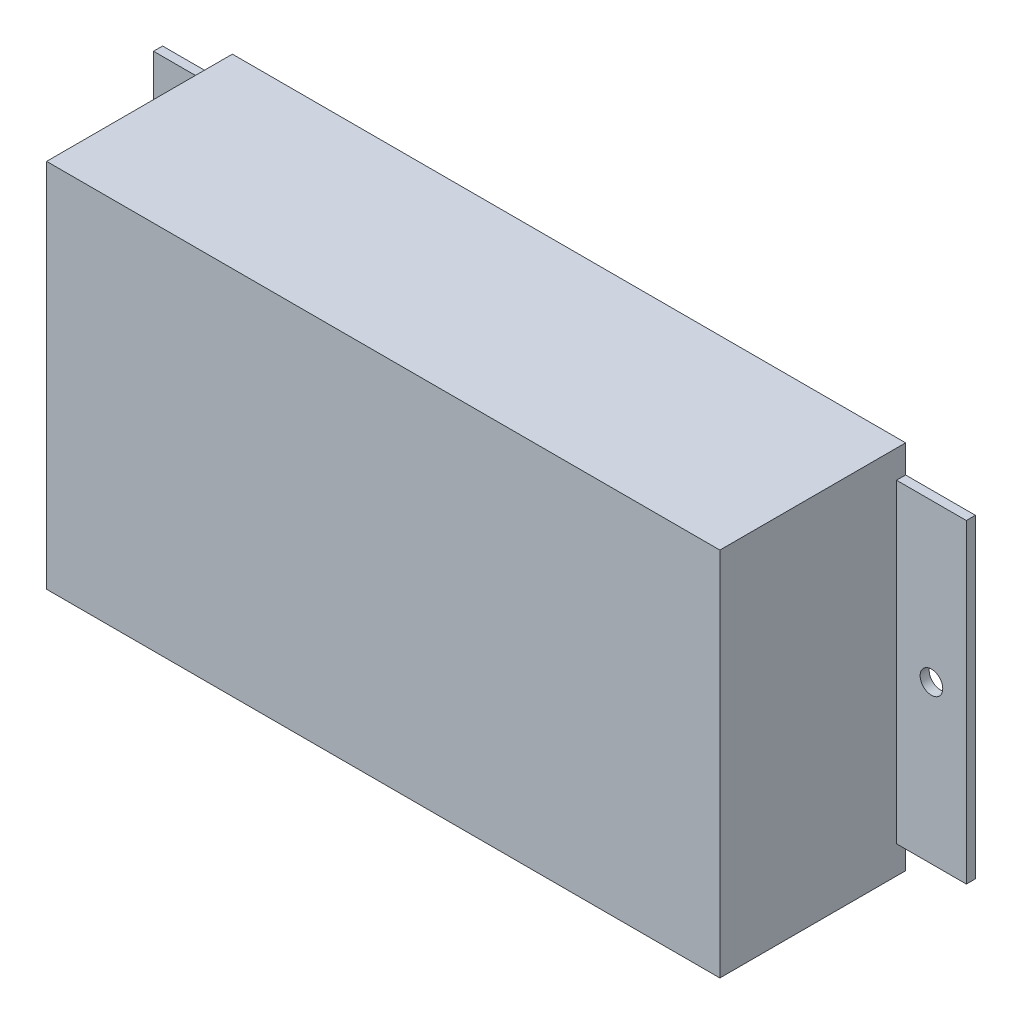
ISO-10303-21;
HEADER;
FILE_DESCRIPTION(('STEP AP214'),'2;1');
FILE_NAME('part.step','',(''),(''),'','','');
FILE_SCHEMA(('AUTOMOTIVE_DESIGN { 1 0 10303 214 1 1 1 1 }'));
ENDSEC;
DATA;
#1=APPLICATION_CONTEXT('core data for automotive mechanical design processes');
#2=APPLICATION_PROTOCOL_DEFINITION('international standard','automotive_design',2000,#1);
#3=PRODUCT_CONTEXT('',#1,'mechanical');
#4=PRODUCT('Part','Part','',(#3));
#5=PRODUCT_RELATED_PRODUCT_CATEGORY('part','',(#4));
#6=PRODUCT_DEFINITION_FORMATION('','',#4);
#7=PRODUCT_DEFINITION_CONTEXT('part definition',#1,'design');
#8=PRODUCT_DEFINITION('design','',#6,#7);
#9=PRODUCT_DEFINITION_SHAPE('','',#8);
#10=(LENGTH_UNIT() NAMED_UNIT(*) SI_UNIT(.MILLI.,.METRE.));
#11=(NAMED_UNIT(*) PLANE_ANGLE_UNIT() SI_UNIT($,.RADIAN.));
#12=(NAMED_UNIT(*) SI_UNIT($,.STERADIAN.) SOLID_ANGLE_UNIT());
#13=UNCERTAINTY_MEASURE_WITH_UNIT(LENGTH_MEASURE(1.E-05),#10,'distance_accuracy_value','');
#14=(GEOMETRIC_REPRESENTATION_CONTEXT(3) GLOBAL_UNCERTAINTY_ASSIGNED_CONTEXT((#13)) GLOBAL_UNIT_ASSIGNED_CONTEXT((#10,
#11,#12)) REPRESENTATION_CONTEXT('',''));
#15=CARTESIAN_POINT('',(0.,0.,0.));
#16=DIRECTION('',(0.,0.,1.));
#17=DIRECTION('',(1.,0.,0.));
#18=AXIS2_PLACEMENT_3D('',#15,#16,#17);
#19=CARTESIAN_POINT('',(148.6,0.,41.));
#20=DIRECTION('',(-1.,0.,0.));
#21=DIRECTION('',(0.,0.,1.));
#22=AXIS2_PLACEMENT_3D('',#19,#20,#21);
#23=PLANE('',#22);
#24=DIRECTION('',(0.,0.,-1.));
#25=VECTOR('',#24,1.);
#26=CARTESIAN_POINT('',(148.6,-75.65,2.));
#27=LINE('',#26,#25);
#28=CARTESIAN_POINT('',(148.6,-75.65,2.));
#29=VERTEX_POINT('',#28);
#30=CARTESIAN_POINT('',(148.6,-75.65,0.));
#31=VERTEX_POINT('',#30);
#32=EDGE_CURVE('E146',#29,#31,#27,.T.);
#33=ORIENTED_EDGE('',*,*,#32,.F.);
#34=DIRECTION('',(0.,1.,0.));
#35=VECTOR('',#34,1.);
#36=CARTESIAN_POINT('',(148.6,-6.15,2.));
#37=LINE('',#36,#35);
#38=CARTESIAN_POINT('',(148.6,-6.15,2.));
#39=VERTEX_POINT('',#38);
#40=EDGE_CURVE('E139',#29,#39,#37,.T.);
#41=ORIENTED_EDGE('',*,*,#40,.T.);
#42=DIRECTION('',(0.,0.,-1.));
#43=VECTOR('',#42,1.);
#44=CARTESIAN_POINT('',(148.6,-6.15,2.));
#45=LINE('',#44,#43);
#46=CARTESIAN_POINT('',(148.6,-6.15,0.));
#47=VERTEX_POINT('',#46);
#48=EDGE_CURVE('E125',#39,#47,#45,.T.);
#49=ORIENTED_EDGE('',*,*,#48,.T.);
#50=DIRECTION('',(0.,1.,0.));
#51=VECTOR('',#50,1.);
#52=CARTESIAN_POINT('',(148.6,0.,0.));
#53=LINE('',#52,#51);
#54=CARTESIAN_POINT('',(148.6,0.,0.));
#55=VERTEX_POINT('',#54);
#56=EDGE_CURVE('E216',#47,#55,#53,.T.);
#57=ORIENTED_EDGE('',*,*,#56,.T.);
#58=DIRECTION('',(0.,0.,-1.));
#59=VECTOR('',#58,1.);
#60=CARTESIAN_POINT('',(148.6,0.,41.));
#61=LINE('',#60,#59);
#62=CARTESIAN_POINT('',(148.6,0.,41.));
#63=VERTEX_POINT('',#62);
#64=EDGE_CURVE('E222',#63,#55,#61,.T.);
#65=ORIENTED_EDGE('',*,*,#64,.F.);
#66=DIRECTION('',(0.,1.,0.));
#67=VECTOR('',#66,1.);
#68=CARTESIAN_POINT('',(148.6,0.,41.));
#69=LINE('',#68,#67);
#70=CARTESIAN_POINT('',(148.6,-81.8,41.));
#71=VERTEX_POINT('',#70);
#72=EDGE_CURVE('E206',#71,#63,#69,.T.);
#73=ORIENTED_EDGE('',*,*,#72,.F.);
#74=DIRECTION('',(0.,0.,-1.));
#75=VECTOR('',#74,1.);
#76=CARTESIAN_POINT('',(148.6,-81.8,41.));
#77=LINE('',#76,#75);
#78=CARTESIAN_POINT('',(148.6,-81.8,0.));
#79=VERTEX_POINT('',#78);
#80=EDGE_CURVE('E46',#71,#79,#77,.T.);
#81=ORIENTED_EDGE('',*,*,#80,.T.);
#82=EDGE_CURVE('E217',#79,#31,#53,.T.);
#83=ORIENTED_EDGE('',*,*,#82,.T.);
#84=EDGE_LOOP('',(#33,#41,#49,#57,#65,#73,#81,#83));
#85=FACE_BOUND('',#84,.T.);
#86=ADVANCED_FACE('F38',(#85),#23,.F.);
#87=CARTESIAN_POINT('',(0.,0.,41.));
#88=DIRECTION('',(1.,0.,0.));
#89=DIRECTION('',(0.,0.,-1.));
#90=AXIS2_PLACEMENT_3D('',#87,#88,#89);
#91=PLANE('',#90);
#92=DIRECTION('',(0.,0.,-1.));
#93=VECTOR('',#92,1.);
#94=CARTESIAN_POINT('',(0.,-6.15,2.));
#95=LINE('',#94,#93);
#96=CARTESIAN_POINT('',(0.,-6.15,2.));
#97=VERTEX_POINT('',#96);
#98=CARTESIAN_POINT('',(0.,-6.15,0.));
#99=VERTEX_POINT('',#98);
#100=EDGE_CURVE('E192',#97,#99,#95,.T.);
#101=ORIENTED_EDGE('',*,*,#100,.F.);
#102=DIRECTION('',(0.,-1.,0.));
#103=VECTOR('',#102,1.);
#104=CARTESIAN_POINT('',(0.,-6.15,2.));
#105=LINE('',#104,#103);
#106=CARTESIAN_POINT('',(0.,-75.65,2.));
#107=VERTEX_POINT('',#106);
#108=EDGE_CURVE('E172',#97,#107,#105,.T.);
#109=ORIENTED_EDGE('',*,*,#108,.T.);
#110=DIRECTION('',(0.,0.,-1.));
#111=VECTOR('',#110,1.);
#112=CARTESIAN_POINT('',(0.,-75.65,2.));
#113=LINE('',#112,#111);
#114=CARTESIAN_POINT('',(0.,-75.65,0.));
#115=VERTEX_POINT('',#114);
#116=EDGE_CURVE('E185',#107,#115,#113,.T.);
#117=ORIENTED_EDGE('',*,*,#116,.T.);
#118=DIRECTION('',(0.,-1.,0.));
#119=VECTOR('',#118,1.);
#120=CARTESIAN_POINT('',(0.,0.,0.));
#121=LINE('',#120,#119);
#122=CARTESIAN_POINT('',(0.,-81.8,0.));
#123=VERTEX_POINT('',#122);
#124=EDGE_CURVE('E194',#115,#123,#121,.T.);
#125=ORIENTED_EDGE('',*,*,#124,.T.);
#126=DIRECTION('',(0.,0.,-1.));
#127=VECTOR('',#126,1.);
#128=CARTESIAN_POINT('',(0.,-81.8,41.));
#129=LINE('',#128,#127);
#130=CARTESIAN_POINT('',(0.,-81.8,41.));
#131=VERTEX_POINT('',#130);
#132=EDGE_CURVE('E11',#131,#123,#129,.T.);
#133=ORIENTED_EDGE('',*,*,#132,.F.);
#134=DIRECTION('',(0.,-1.,0.));
#135=VECTOR('',#134,1.);
#136=CARTESIAN_POINT('',(0.,0.,41.));
#137=LINE('',#136,#135);
#138=CARTESIAN_POINT('',(0.,0.,41.));
#139=VERTEX_POINT('',#138);
#140=EDGE_CURVE('E200',#139,#131,#137,.T.);
#141=ORIENTED_EDGE('',*,*,#140,.F.);
#142=DIRECTION('',(0.,0.,-1.));
#143=VECTOR('',#142,1.);
#144=CARTESIAN_POINT('',(0.,0.,41.));
#145=LINE('',#144,#143);
#146=CARTESIAN_POINT('',(0.,0.,0.));
#147=VERTEX_POINT('',#146);
#148=EDGE_CURVE('E210',#139,#147,#145,.T.);
#149=ORIENTED_EDGE('',*,*,#148,.T.);
#150=EDGE_CURVE('E211',#147,#99,#121,.T.);
#151=ORIENTED_EDGE('',*,*,#150,.T.);
#152=EDGE_LOOP('',(#101,#109,#117,#125,#133,#141,#149,#151));
#153=FACE_BOUND('',#152,.T.);
#154=ADVANCED_FACE('F40',(#153),#91,.F.);
#155=CARTESIAN_POINT('',(0.,-81.8,41.));
#156=DIRECTION('',(0.,1.,0.));
#157=DIRECTION('',(0.,0.,1.));
#158=AXIS2_PLACEMENT_3D('',#155,#156,#157);
#159=PLANE('',#158);
#160=DIRECTION('',(1.,0.,0.));
#161=VECTOR('',#160,1.);
#162=CARTESIAN_POINT('',(0.,-81.8,0.));
#163=LINE('',#162,#161);
#164=EDGE_CURVE('E214',#123,#79,#163,.T.);
#165=ORIENTED_EDGE('',*,*,#164,.T.);
#166=ORIENTED_EDGE('',*,*,#80,.F.);
#167=DIRECTION('',(1.,0.,0.));
#168=VECTOR('',#167,1.);
#169=CARTESIAN_POINT('',(0.,-81.8,41.));
#170=LINE('',#169,#168);
#171=EDGE_CURVE('E203',#131,#71,#170,.T.);
#172=ORIENTED_EDGE('',*,*,#171,.F.);
#173=ORIENTED_EDGE('',*,*,#132,.T.);
#174=EDGE_LOOP('',(#165,#166,#172,#173));
#175=FACE_BOUND('',#174,.T.);
#176=ADVANCED_FACE('F251',(#175),#159,.F.);
#177=CARTESIAN_POINT('',(0.,0.,41.));
#178=DIRECTION('',(0.,-1.,0.));
#179=DIRECTION('',(0.,0.,-1.));
#180=AXIS2_PLACEMENT_3D('',#177,#178,#179);
#181=PLANE('',#180);
#182=DIRECTION('',(-1.,0.,0.));
#183=VECTOR('',#182,1.);
#184=CARTESIAN_POINT('',(0.,0.,0.));
#185=LINE('',#184,#183);
#186=EDGE_CURVE('E204',#55,#147,#185,.T.);
#187=ORIENTED_EDGE('',*,*,#186,.T.);
#188=ORIENTED_EDGE('',*,*,#148,.F.);
#189=DIRECTION('',(-1.,0.,0.));
#190=VECTOR('',#189,1.);
#191=CARTESIAN_POINT('',(0.,0.,41.));
#192=LINE('',#191,#190);
#193=EDGE_CURVE('E208',#63,#139,#192,.T.);
#194=ORIENTED_EDGE('',*,*,#193,.F.);
#195=ORIENTED_EDGE('',*,*,#64,.T.);
#196=EDGE_LOOP('',(#187,#188,#194,#195));
#197=FACE_BOUND('',#196,.T.);
#198=ADVANCED_FACE('F245',(#197),#181,.F.);
#199=CARTESIAN_POINT('',(0.,0.,41.));
#200=DIRECTION('',(0.,0.,1.));
#201=DIRECTION('',(1.,0.,0.));
#202=AXIS2_PLACEMENT_3D('',#199,#200,#201);
#203=PLANE('',#202);
#204=ORIENTED_EDGE('',*,*,#140,.T.);
#205=ORIENTED_EDGE('',*,*,#171,.T.);
#206=ORIENTED_EDGE('',*,*,#72,.T.);
#207=ORIENTED_EDGE('',*,*,#193,.T.);
#208=EDGE_LOOP('',(#204,#205,#206,#207));
#209=FACE_BOUND('',#208,.T.);
#210=ADVANCED_FACE('F249',(#209),#203,.T.);
#211=CARTESIAN_POINT('',(0.,0.,0.));
#212=DIRECTION('',(0.,0.,1.));
#213=DIRECTION('',(1.,0.,0.));
#214=AXIS2_PLACEMENT_3D('',#211,#212,#213);
#215=PLANE('',#214);
#216=ORIENTED_EDGE('',*,*,#150,.F.);
#217=ORIENTED_EDGE('',*,*,#186,.F.);
#218=ORIENTED_EDGE('',*,*,#56,.F.);
#219=DIRECTION('',(1.,0.,0.));
#220=VECTOR('',#219,1.);
#221=CARTESIAN_POINT('',(148.6,-6.15,0.));
#222=LINE('',#221,#220);
#223=CARTESIAN_POINT('',(164.,-6.15,0.));
#224=VERTEX_POINT('',#223);
#225=EDGE_CURVE('E53',#47,#224,#222,.T.);
#226=ORIENTED_EDGE('',*,*,#225,.T.);
#227=DIRECTION('',(0.,-1.,0.));
#228=VECTOR('',#227,1.);
#229=CARTESIAN_POINT('',(164.,-6.15,0.));
#230=LINE('',#229,#228);
#231=CARTESIAN_POINT('',(164.,-75.65,0.));
#232=VERTEX_POINT('',#231);
#233=EDGE_CURVE('E150',#224,#232,#230,.T.);
#234=ORIENTED_EDGE('',*,*,#233,.T.);
#235=DIRECTION('',(-1.,0.,0.));
#236=VECTOR('',#235,1.);
#237=CARTESIAN_POINT('',(148.6,-75.65,0.));
#238=LINE('',#237,#236);
#239=EDGE_CURVE('E147',#232,#31,#238,.T.);
#240=ORIENTED_EDGE('',*,*,#239,.T.);
#241=ORIENTED_EDGE('',*,*,#82,.F.);
#242=ORIENTED_EDGE('',*,*,#164,.F.);
#243=ORIENTED_EDGE('',*,*,#124,.F.);
#244=DIRECTION('',(-1.,0.,0.));
#245=VECTOR('',#244,1.);
#246=CARTESIAN_POINT('',(0.,-75.65,0.));
#247=LINE('',#246,#245);
#248=CARTESIAN_POINT('',(-15.4,-75.65,0.));
#249=VERTEX_POINT('',#248);
#250=EDGE_CURVE('E61',#115,#249,#247,.T.);
#251=ORIENTED_EDGE('',*,*,#250,.T.);
#252=DIRECTION('',(0.,1.,0.));
#253=VECTOR('',#252,1.);
#254=CARTESIAN_POINT('',(-15.4,-6.15,0.));
#255=LINE('',#254,#253);
#256=CARTESIAN_POINT('',(-15.4,-6.15,0.));
#257=VERTEX_POINT('',#256);
#258=EDGE_CURVE('E187',#249,#257,#255,.T.);
#259=ORIENTED_EDGE('',*,*,#258,.T.);
#260=DIRECTION('',(1.,0.,0.));
#261=VECTOR('',#260,1.);
#262=CARTESIAN_POINT('',(0.,-6.15,0.));
#263=LINE('',#262,#261);
#264=EDGE_CURVE('E176',#257,#99,#263,.T.);
#265=ORIENTED_EDGE('',*,*,#264,.T.);
#266=EDGE_LOOP('',(#216,#217,#218,#226,#234,#240,#241,#242,#243,#251,#259,#265));
#267=FACE_BOUND('',#266,.T.);
#268=CARTESIAN_POINT('',(-7.7,-40.9,0.));
#269=DIRECTION('',(0.,0.,-1.));
#270=DIRECTION('',(-1.,0.,0.));
#271=AXIS2_PLACEMENT_3D('',#268,#269,#270);
#272=CIRCLE('',#271,2.5);
#273=CARTESIAN_POINT('',(-10.2,-40.9,0.));
#274=VERTEX_POINT('',#273);
#275=EDGE_CURVE('E163',#274,#274,#272,.T.);
#276=ORIENTED_EDGE('',*,*,#275,.F.);
#277=EDGE_LOOP('',(#276));
#278=FACE_BOUND('',#277,.T.);
#279=CARTESIAN_POINT('',(156.3,-40.9,0.));
#280=DIRECTION('',(0.,0.,-1.));
#281=DIRECTION('',(1.,0.,0.));
#282=AXIS2_PLACEMENT_3D('',#279,#280,#281);
#283=CIRCLE('',#282,2.5);
#284=CARTESIAN_POINT('',(158.8,-40.9,0.));
#285=VERTEX_POINT('',#284);
#286=EDGE_CURVE('E153',#285,#285,#283,.T.);
#287=ORIENTED_EDGE('',*,*,#286,.F.);
#288=EDGE_LOOP('',(#287));
#289=FACE_BOUND('',#288,.T.);
#290=ADVANCED_FACE('F233',(#267,#278,#289),#215,.F.);
#291=CARTESIAN_POINT('',(0.,-6.15,2.));
#292=DIRECTION('',(0.,1.,0.));
#293=DIRECTION('',(0.,0.,1.));
#294=AXIS2_PLACEMENT_3D('',#291,#292,#293);
#295=PLANE('',#294);
#296=ORIENTED_EDGE('',*,*,#264,.F.);
#297=DIRECTION('',(0.,0.,-1.));
#298=VECTOR('',#297,1.);
#299=CARTESIAN_POINT('',(-15.4,-6.15,2.));
#300=LINE('',#299,#298);
#301=CARTESIAN_POINT('',(-15.4,-6.15,2.));
#302=VERTEX_POINT('',#301);
#303=EDGE_CURVE('E195',#302,#257,#300,.T.);
#304=ORIENTED_EDGE('',*,*,#303,.F.);
#305=DIRECTION('',(1.,0.,0.));
#306=VECTOR('',#305,1.);
#307=CARTESIAN_POINT('',(0.,-6.15,2.));
#308=LINE('',#307,#306);
#309=EDGE_CURVE('E182',#302,#97,#308,.T.);
#310=ORIENTED_EDGE('',*,*,#309,.T.);
#311=ORIENTED_EDGE('',*,*,#100,.T.);
#312=EDGE_LOOP('',(#296,#304,#310,#311));
#313=FACE_BOUND('',#312,.T.);
#314=ADVANCED_FACE('F258',(#313),#295,.T.);
#315=CARTESIAN_POINT('',(-15.4,-6.15,2.));
#316=DIRECTION('',(-1.,0.,0.));
#317=DIRECTION('',(0.,-1.,0.));
#318=AXIS2_PLACEMENT_3D('',#315,#316,#317);
#319=PLANE('',#318);
#320=ORIENTED_EDGE('',*,*,#258,.F.);
#321=DIRECTION('',(0.,0.,-1.));
#322=VECTOR('',#321,1.);
#323=CARTESIAN_POINT('',(-15.4,-75.65,2.));
#324=LINE('',#323,#322);
#325=CARTESIAN_POINT('',(-15.4,-75.65,2.));
#326=VERTEX_POINT('',#325);
#327=EDGE_CURVE('E197',#326,#249,#324,.T.);
#328=ORIENTED_EDGE('',*,*,#327,.F.);
#329=DIRECTION('',(0.,1.,0.));
#330=VECTOR('',#329,1.);
#331=CARTESIAN_POINT('',(-15.4,-6.15,2.));
#332=LINE('',#331,#330);
#333=EDGE_CURVE('E179',#326,#302,#332,.T.);
#334=ORIENTED_EDGE('',*,*,#333,.T.);
#335=ORIENTED_EDGE('',*,*,#303,.T.);
#336=EDGE_LOOP('',(#320,#328,#334,#335));
#337=FACE_BOUND('',#336,.T.);
#338=ADVANCED_FACE('F265',(#337),#319,.T.);
#339=CARTESIAN_POINT('',(0.,-75.65,2.));
#340=DIRECTION('',(0.,-1.,0.));
#341=DIRECTION('',(0.,0.,-1.));
#342=AXIS2_PLACEMENT_3D('',#339,#340,#341);
#343=PLANE('',#342);
#344=ORIENTED_EDGE('',*,*,#250,.F.);
#345=ORIENTED_EDGE('',*,*,#116,.F.);
#346=DIRECTION('',(-1.,0.,0.));
#347=VECTOR('',#346,1.);
#348=CARTESIAN_POINT('',(0.,-75.65,2.));
#349=LINE('',#348,#347);
#350=EDGE_CURVE('E175',#107,#326,#349,.T.);
#351=ORIENTED_EDGE('',*,*,#350,.T.);
#352=ORIENTED_EDGE('',*,*,#327,.T.);
#353=EDGE_LOOP('',(#344,#345,#351,#352));
#354=FACE_BOUND('',#353,.T.);
#355=ADVANCED_FACE('F264',(#354),#343,.T.);
#356=CARTESIAN_POINT('',(0.,0.,2.));
#357=DIRECTION('',(0.,0.,-1.));
#358=DIRECTION('',(-1.,0.,0.));
#359=AXIS2_PLACEMENT_3D('',#356,#357,#358);
#360=PLANE('',#359);
#361=CARTESIAN_POINT('',(-7.7,-40.9,2.));
#362=DIRECTION('',(0.,0.,-1.));
#363=DIRECTION('',(-1.,0.,0.));
#364=AXIS2_PLACEMENT_3D('',#361,#362,#363);
#365=CIRCLE('',#364,2.5);
#366=CARTESIAN_POINT('',(-10.2,-40.9,2.));
#367=VERTEX_POINT('',#366);
#368=EDGE_CURVE('E167',#367,#367,#365,.T.);
#369=ORIENTED_EDGE('',*,*,#368,.T.);
#370=EDGE_LOOP('',(#369));
#371=FACE_BOUND('',#370,.T.);
#372=ORIENTED_EDGE('',*,*,#108,.F.);
#373=ORIENTED_EDGE('',*,*,#309,.F.);
#374=ORIENTED_EDGE('',*,*,#333,.F.);
#375=ORIENTED_EDGE('',*,*,#350,.F.);
#376=EDGE_LOOP('',(#372,#373,#374,#375));
#377=FACE_BOUND('',#376,.T.);
#378=ADVANCED_FACE('F262',(#371,#377),#360,.F.);
#379=CARTESIAN_POINT('',(-7.7,-40.9,2.));
#380=DIRECTION('',(0.,0.,-1.));
#381=DIRECTION('',(-1.,0.,0.));
#382=AXIS2_PLACEMENT_3D('',#379,#380,#381);
#383=CYLINDRICAL_SURFACE('',#382,2.5);
#384=ORIENTED_EDGE('',*,*,#368,.F.);
#385=EDGE_LOOP('',(#384));
#386=FACE_BOUND('',#385,.T.);
#387=ORIENTED_EDGE('',*,*,#275,.T.);
#388=EDGE_LOOP('',(#387));
#389=FACE_BOUND('',#388,.T.);
#390=ADVANCED_FACE('F320',(#386,#389),#383,.F.);
#391=CARTESIAN_POINT('',(148.6,-75.65,2.));
#392=DIRECTION('',(0.,-1.,0.));
#393=DIRECTION('',(0.,0.,-1.));
#394=AXIS2_PLACEMENT_3D('',#391,#392,#393);
#395=PLANE('',#394);
#396=ORIENTED_EDGE('',*,*,#239,.F.);
#397=DIRECTION('',(0.,0.,-1.));
#398=VECTOR('',#397,1.);
#399=CARTESIAN_POINT('',(164.,-75.65,2.));
#400=LINE('',#399,#398);
#401=CARTESIAN_POINT('',(164.,-75.65,2.));
#402=VERTEX_POINT('',#401);
#403=EDGE_CURVE('E164',#402,#232,#400,.T.);
#404=ORIENTED_EDGE('',*,*,#403,.F.);
#405=DIRECTION('',(-1.,0.,0.));
#406=VECTOR('',#405,1.);
#407=CARTESIAN_POINT('',(148.6,-75.65,2.));
#408=LINE('',#407,#406);
#409=EDGE_CURVE('E133',#402,#29,#408,.T.);
#410=ORIENTED_EDGE('',*,*,#409,.T.);
#411=ORIENTED_EDGE('',*,*,#32,.T.);
#412=EDGE_LOOP('',(#396,#404,#410,#411));
#413=FACE_BOUND('',#412,.T.);
#414=ADVANCED_FACE('F239',(#413),#395,.T.);
#415=CARTESIAN_POINT('',(164.,-6.15,2.));
#416=DIRECTION('',(1.,0.,0.));
#417=DIRECTION('',(0.,1.,0.));
#418=AXIS2_PLACEMENT_3D('',#415,#416,#417);
#419=PLANE('',#418);
#420=ORIENTED_EDGE('',*,*,#233,.F.);
#421=DIRECTION('',(0.,0.,-1.));
#422=VECTOR('',#421,1.);
#423=CARTESIAN_POINT('',(164.,-6.15,2.));
#424=LINE('',#423,#422);
#425=CARTESIAN_POINT('',(164.,-6.15,2.));
#426=VERTEX_POINT('',#425);
#427=EDGE_CURVE('E132',#426,#224,#424,.T.);
#428=ORIENTED_EDGE('',*,*,#427,.F.);
#429=DIRECTION('',(0.,-1.,0.));
#430=VECTOR('',#429,1.);
#431=CARTESIAN_POINT('',(164.,-6.15,2.));
#432=LINE('',#431,#430);
#433=EDGE_CURVE('E142',#426,#402,#432,.T.);
#434=ORIENTED_EDGE('',*,*,#433,.T.);
#435=ORIENTED_EDGE('',*,*,#403,.T.);
#436=EDGE_LOOP('',(#420,#428,#434,#435));
#437=FACE_BOUND('',#436,.T.);
#438=ADVANCED_FACE('F241',(#437),#419,.T.);
#439=CARTESIAN_POINT('',(148.6,-6.15,2.));
#440=DIRECTION('',(0.,1.,0.));
#441=DIRECTION('',(0.,0.,1.));
#442=AXIS2_PLACEMENT_3D('',#439,#440,#441);
#443=PLANE('',#442);
#444=ORIENTED_EDGE('',*,*,#225,.F.);
#445=ORIENTED_EDGE('',*,*,#48,.F.);
#446=DIRECTION('',(1.,0.,0.));
#447=VECTOR('',#446,1.);
#448=CARTESIAN_POINT('',(148.6,-6.15,2.));
#449=LINE('',#448,#447);
#450=EDGE_CURVE('E128',#39,#426,#449,.T.);
#451=ORIENTED_EDGE('',*,*,#450,.T.);
#452=ORIENTED_EDGE('',*,*,#427,.T.);
#453=EDGE_LOOP('',(#444,#445,#451,#452));
#454=FACE_BOUND('',#453,.T.);
#455=ADVANCED_FACE('F127',(#454),#443,.T.);
#456=CARTESIAN_POINT('',(0.,0.,2.));
#457=DIRECTION('',(0.,0.,1.));
#458=DIRECTION('',(1.,0.,0.));
#459=AXIS2_PLACEMENT_3D('',#456,#457,#458);
#460=PLANE('',#459);
#461=CARTESIAN_POINT('',(156.3,-40.9,2.));
#462=DIRECTION('',(0.,0.,-1.));
#463=DIRECTION('',(1.,0.,0.));
#464=AXIS2_PLACEMENT_3D('',#461,#462,#463);
#465=CIRCLE('',#464,2.5);
#466=CARTESIAN_POINT('',(158.8,-40.9,2.));
#467=VERTEX_POINT('',#466);
#468=EDGE_CURVE('E159',#467,#467,#465,.T.);
#469=ORIENTED_EDGE('',*,*,#468,.T.);
#470=EDGE_LOOP('',(#469));
#471=FACE_BOUND('',#470,.T.);
#472=ORIENTED_EDGE('',*,*,#40,.F.);
#473=ORIENTED_EDGE('',*,*,#409,.F.);
#474=ORIENTED_EDGE('',*,*,#433,.F.);
#475=ORIENTED_EDGE('',*,*,#450,.F.);
#476=EDGE_LOOP('',(#472,#473,#474,#475));
#477=FACE_BOUND('',#476,.T.);
#478=ADVANCED_FACE('F137',(#471,#477),#460,.T.);
#479=CARTESIAN_POINT('',(156.3,-40.9,2.));
#480=DIRECTION('',(0.,0.,-1.));
#481=DIRECTION('',(-1.,0.,0.));
#482=AXIS2_PLACEMENT_3D('',#479,#480,#481);
#483=CYLINDRICAL_SURFACE('',#482,2.5);
#484=ORIENTED_EDGE('',*,*,#468,.F.);
#485=EDGE_LOOP('',(#484));
#486=FACE_BOUND('',#485,.T.);
#487=ORIENTED_EDGE('',*,*,#286,.T.);
#488=EDGE_LOOP('',(#487));
#489=FACE_BOUND('',#488,.T.);
#490=ADVANCED_FACE('F363',(#486,#489),#483,.F.);
#491=CLOSED_SHELL('',(#86,#154,#176,#198,#210,#290,#314,#338,#355,#378,#390,#414,#438,#455,#478,#490));
#492=MANIFOLD_SOLID_BREP('B2',#491);
#493=ADVANCED_BREP_SHAPE_REPRESENTATION('',(#18,#492),#14);
#494=SHAPE_DEFINITION_REPRESENTATION(#9,#493);
ENDSEC;
END-ISO-10303-21;
